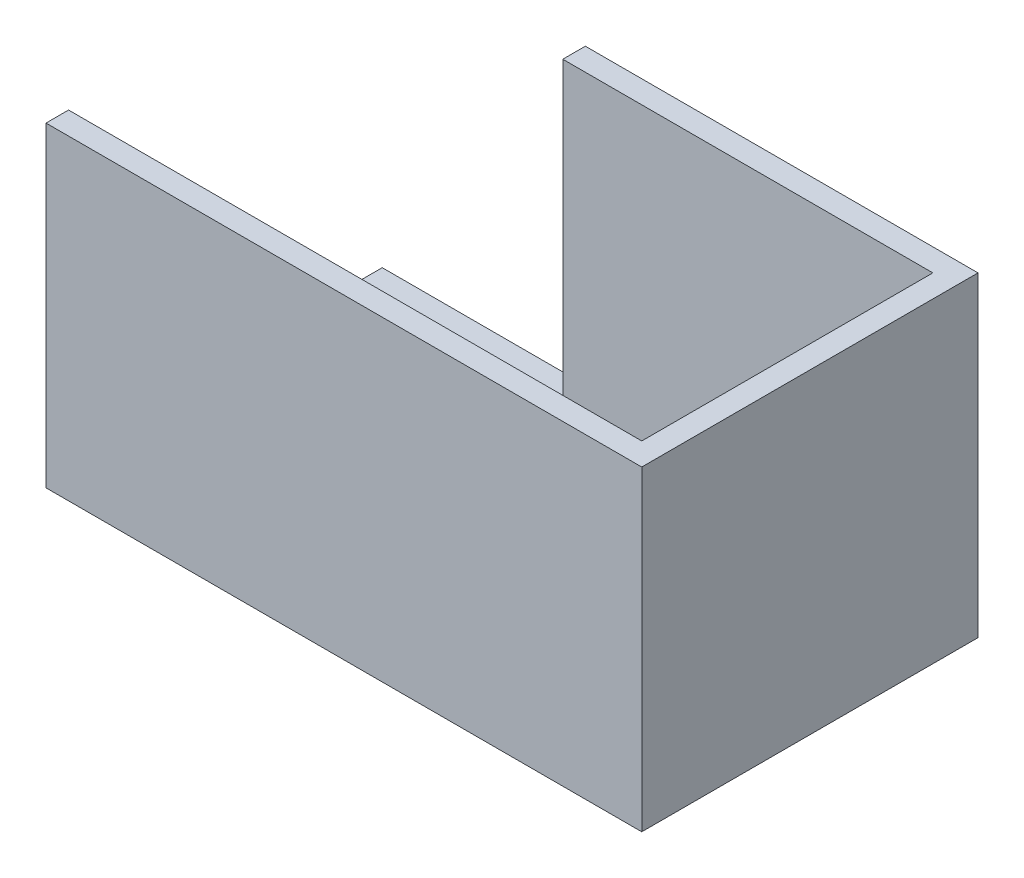
ISO-10303-21;
HEADER;
FILE_DESCRIPTION(('STEP AP214'),'2;1');
FILE_NAME('part.step','',(''),(''),'','','');
FILE_SCHEMA(('AUTOMOTIVE_DESIGN { 1 0 10303 214 1 1 1 1 }'));
ENDSEC;
DATA;
#1=APPLICATION_CONTEXT('core data for automotive mechanical design processes');
#2=APPLICATION_PROTOCOL_DEFINITION('international standard','automotive_design',2000,#1);
#3=PRODUCT_CONTEXT('',#1,'mechanical');
#4=PRODUCT('Part','Part','',(#3));
#5=PRODUCT_RELATED_PRODUCT_CATEGORY('part','',(#4));
#6=PRODUCT_DEFINITION_FORMATION('','',#4);
#7=PRODUCT_DEFINITION_CONTEXT('part definition',#1,'design');
#8=PRODUCT_DEFINITION('design','',#6,#7);
#9=PRODUCT_DEFINITION_SHAPE('','',#8);
#10=(LENGTH_UNIT() NAMED_UNIT(*) SI_UNIT(.MILLI.,.METRE.));
#11=(NAMED_UNIT(*) PLANE_ANGLE_UNIT() SI_UNIT($,.RADIAN.));
#12=(NAMED_UNIT(*) SI_UNIT($,.STERADIAN.) SOLID_ANGLE_UNIT());
#13=UNCERTAINTY_MEASURE_WITH_UNIT(LENGTH_MEASURE(1.E-05),#10,'distance_accuracy_value','');
#14=(GEOMETRIC_REPRESENTATION_CONTEXT(3) GLOBAL_UNCERTAINTY_ASSIGNED_CONTEXT((#13)) GLOBAL_UNIT_ASSIGNED_CONTEXT((#10,
#11,#12)) REPRESENTATION_CONTEXT('',''));
#15=CARTESIAN_POINT('',(0.,0.,0.));
#16=DIRECTION('',(0.,0.,1.));
#17=DIRECTION('',(1.,0.,0.));
#18=AXIS2_PLACEMENT_3D('',#15,#16,#17);
#19=CARTESIAN_POINT('',(0.,2.,0.));
#20=DIRECTION('',(0.,1.,0.));
#21=DIRECTION('',(0.,0.,1.));
#22=AXIS2_PLACEMENT_3D('',#19,#20,#21);
#23=PLANE('',#22);
#24=DIRECTION('',(-1.,0.,0.));
#25=VECTOR('',#24,1.);
#26=CARTESIAN_POINT('',(0.,2.,2.));
#27=LINE('',#26,#25);
#28=CARTESIAN_POINT('',(50.8,2.,2.));
#29=VERTEX_POINT('',#28);
#30=CARTESIAN_POINT('',(18.,2.,2.));
#31=VERTEX_POINT('',#30);
#32=EDGE_CURVE('E304',#29,#31,#27,.T.);
#33=ORIENTED_EDGE('',*,*,#32,.T.);
#34=DIRECTION('',(0.,0.,-1.));
#35=VECTOR('',#34,1.);
#36=CARTESIAN_POINT('',(18.,2.,0.));
#37=LINE('',#36,#35);
#38=CARTESIAN_POINT('',(18.,2.,0.));
#39=VERTEX_POINT('',#38);
#40=EDGE_CURVE('E53',#31,#39,#37,.T.);
#41=ORIENTED_EDGE('',*,*,#40,.T.);
#42=DIRECTION('',(-1.,0.,0.));
#43=VECTOR('',#42,1.);
#44=CARTESIAN_POINT('',(0.,2.,0.));
#45=LINE('',#44,#43);
#46=CARTESIAN_POINT('',(0.,2.,0.));
#47=VERTEX_POINT('',#46);
#48=EDGE_CURVE('E61',#39,#47,#45,.T.);
#49=ORIENTED_EDGE('',*,*,#48,.T.);
#50=DIRECTION('',(0.,0.,1.));
#51=VECTOR('',#50,1.);
#52=CARTESIAN_POINT('',(0.,2.,0.));
#53=LINE('',#52,#51);
#54=CARTESIAN_POINT('',(0.,2.,27.8));
#55=VERTEX_POINT('',#54);
#56=EDGE_CURVE('E107',#47,#55,#53,.T.);
#57=ORIENTED_EDGE('',*,*,#56,.T.);
#58=DIRECTION('',(1.,0.,0.));
#59=VECTOR('',#58,1.);
#60=CARTESIAN_POINT('',(0.,2.,27.8));
#61=LINE('',#60,#59);
#62=CARTESIAN_POINT('',(50.8,2.,27.8));
#63=VERTEX_POINT('',#62);
#64=EDGE_CURVE('E283',#55,#63,#61,.T.);
#65=ORIENTED_EDGE('',*,*,#64,.T.);
#66=DIRECTION('',(0.,0.,-1.));
#67=VECTOR('',#66,1.);
#68=CARTESIAN_POINT('',(50.8,2.,0.));
#69=LINE('',#68,#67);
#70=EDGE_CURVE('E306',#63,#29,#69,.T.);
#71=ORIENTED_EDGE('',*,*,#70,.T.);
#72=EDGE_LOOP('',(#33,#41,#49,#57,#65,#71));
#73=FACE_BOUND('',#72,.T.);
#74=ADVANCED_FACE('F38',(#73),#23,.T.);
#75=CARTESIAN_POINT('',(0.,2.,0.));
#76=DIRECTION('',(1.,0.,0.));
#77=DIRECTION('',(0.,0.,-1.));
#78=AXIS2_PLACEMENT_3D('',#75,#76,#77);
#79=PLANE('',#78);
#80=DIRECTION('',(0.,0.,1.));
#81=VECTOR('',#80,1.);
#82=CARTESIAN_POINT('',(0.,0.,0.));
#83=LINE('',#82,#81);
#84=CARTESIAN_POINT('',(0.,0.,0.));
#85=VERTEX_POINT('',#84);
#86=CARTESIAN_POINT('',(0.,0.,29.8));
#87=VERTEX_POINT('',#86);
#88=EDGE_CURVE('E106',#85,#87,#83,.T.);
#89=ORIENTED_EDGE('',*,*,#88,.T.);
#90=DIRECTION('',(0.,-1.,0.));
#91=VECTOR('',#90,1.);
#92=CARTESIAN_POINT('',(0.,2.,29.8));
#93=LINE('',#92,#91);
#94=CARTESIAN_POINT('',(0.,28.,29.8));
#95=VERTEX_POINT('',#94);
#96=EDGE_CURVE('E11',#95,#87,#93,.T.);
#97=ORIENTED_EDGE('',*,*,#96,.F.);
#98=DIRECTION('',(0.,0.,1.));
#99=VECTOR('',#98,1.);
#100=CARTESIAN_POINT('',(0.,28.,0.));
#101=LINE('',#100,#99);
#102=CARTESIAN_POINT('',(0.,28.,27.8));
#103=VERTEX_POINT('',#102);
#104=EDGE_CURVE('E296',#103,#95,#101,.T.);
#105=ORIENTED_EDGE('',*,*,#104,.F.);
#106=DIRECTION('',(0.,-1.,0.));
#107=VECTOR('',#106,1.);
#108=CARTESIAN_POINT('',(0.,28.,27.8));
#109=LINE('',#108,#107);
#110=EDGE_CURVE('E312',#103,#55,#109,.T.);
#111=ORIENTED_EDGE('',*,*,#110,.T.);
#112=ORIENTED_EDGE('',*,*,#56,.F.);
#113=DIRECTION('',(0.,-1.,0.));
#114=VECTOR('',#113,1.);
#115=CARTESIAN_POINT('',(0.,2.,0.));
#116=LINE('',#115,#114);
#117=EDGE_CURVE('E101',#47,#85,#116,.T.);
#118=ORIENTED_EDGE('',*,*,#117,.T.);
#119=EDGE_LOOP('',(#89,#97,#105,#111,#112,#118));
#120=FACE_BOUND('',#119,.T.);
#121=ADVANCED_FACE('F40',(#120),#79,.F.);
#122=CARTESIAN_POINT('',(0.,2.,29.8));
#123=DIRECTION('',(0.,0.,-1.));
#124=DIRECTION('',(-1.,0.,0.));
#125=AXIS2_PLACEMENT_3D('',#122,#123,#124);
#126=PLANE('',#125);
#127=DIRECTION('',(1.,0.,0.));
#128=VECTOR('',#127,1.);
#129=CARTESIAN_POINT('',(0.,0.,29.8));
#130=LINE('',#129,#128);
#131=CARTESIAN_POINT('',(52.8,0.,29.8));
#132=VERTEX_POINT('',#131);
#133=EDGE_CURVE('E92',#87,#132,#130,.T.);
#134=ORIENTED_EDGE('',*,*,#133,.T.);
#135=DIRECTION('',(0.,-1.,0.));
#136=VECTOR('',#135,1.);
#137=CARTESIAN_POINT('',(52.8,2.,29.8));
#138=LINE('',#137,#136);
#139=CARTESIAN_POINT('',(52.8,28.,29.8));
#140=VERTEX_POINT('',#139);
#141=EDGE_CURVE('E46',#140,#132,#138,.T.);
#142=ORIENTED_EDGE('',*,*,#141,.F.);
#143=DIRECTION('',(1.,0.,0.));
#144=VECTOR('',#143,1.);
#145=CARTESIAN_POINT('',(0.,28.,29.8));
#146=LINE('',#145,#144);
#147=EDGE_CURVE('E125',#95,#140,#146,.T.);
#148=ORIENTED_EDGE('',*,*,#147,.F.);
#149=ORIENTED_EDGE('',*,*,#96,.T.);
#150=EDGE_LOOP('',(#134,#142,#148,#149));
#151=FACE_BOUND('',#150,.T.);
#152=ADVANCED_FACE('F119',(#151),#126,.F.);
#153=CARTESIAN_POINT('',(52.8,2.,0.));
#154=DIRECTION('',(-1.,0.,0.));
#155=DIRECTION('',(0.,0.,1.));
#156=AXIS2_PLACEMENT_3D('',#153,#154,#155);
#157=PLANE('',#156);
#158=DIRECTION('',(0.,0.,-1.));
#159=VECTOR('',#158,1.);
#160=CARTESIAN_POINT('',(52.8,0.,0.));
#161=LINE('',#160,#159);
#162=CARTESIAN_POINT('',(52.8,0.,0.));
#163=VERTEX_POINT('',#162);
#164=EDGE_CURVE('E81',#132,#163,#161,.T.);
#165=ORIENTED_EDGE('',*,*,#164,.T.);
#166=DIRECTION('',(0.,-1.,0.));
#167=VECTOR('',#166,1.);
#168=CARTESIAN_POINT('',(52.8,2.,0.));
#169=LINE('',#168,#167);
#170=CARTESIAN_POINT('',(52.8,28.,0.));
#171=VERTEX_POINT('',#170);
#172=EDGE_CURVE('E86',#171,#163,#169,.T.);
#173=ORIENTED_EDGE('',*,*,#172,.F.);
#174=DIRECTION('',(0.,0.,-1.));
#175=VECTOR('',#174,1.);
#176=CARTESIAN_POINT('',(52.8,28.,0.));
#177=LINE('',#176,#175);
#178=EDGE_CURVE('E299',#140,#171,#177,.T.);
#179=ORIENTED_EDGE('',*,*,#178,.F.);
#180=ORIENTED_EDGE('',*,*,#141,.T.);
#181=EDGE_LOOP('',(#165,#173,#179,#180));
#182=FACE_BOUND('',#181,.T.);
#183=ADVANCED_FACE('F83',(#182),#157,.F.);
#184=CARTESIAN_POINT('',(0.,2.,0.));
#185=DIRECTION('',(0.,0.,1.));
#186=DIRECTION('',(1.,0.,0.));
#187=AXIS2_PLACEMENT_3D('',#184,#185,#186);
#188=PLANE('',#187);
#189=DIRECTION('',(-1.,0.,0.));
#190=VECTOR('',#189,1.);
#191=CARTESIAN_POINT('',(0.,0.,0.));
#192=LINE('',#191,#190);
#193=EDGE_CURVE('E91',#163,#85,#192,.T.);
#194=ORIENTED_EDGE('',*,*,#193,.T.);
#195=ORIENTED_EDGE('',*,*,#117,.F.);
#196=ORIENTED_EDGE('',*,*,#48,.F.);
#197=DIRECTION('',(0.,-1.,0.));
#198=VECTOR('',#197,1.);
#199=CARTESIAN_POINT('',(18.,28.,0.));
#200=LINE('',#199,#198);
#201=CARTESIAN_POINT('',(18.,28.,0.));
#202=VERTEX_POINT('',#201);
#203=EDGE_CURVE('E302',#202,#39,#200,.T.);
#204=ORIENTED_EDGE('',*,*,#203,.F.);
#205=DIRECTION('',(-1.,0.,0.));
#206=VECTOR('',#205,1.);
#207=CARTESIAN_POINT('',(0.,28.,0.));
#208=LINE('',#207,#206);
#209=EDGE_CURVE('E100',#171,#202,#208,.T.);
#210=ORIENTED_EDGE('',*,*,#209,.F.);
#211=ORIENTED_EDGE('',*,*,#172,.T.);
#212=EDGE_LOOP('',(#194,#195,#196,#204,#210,#211));
#213=FACE_BOUND('',#212,.T.);
#214=ADVANCED_FACE('F96',(#213),#188,.F.);
#215=CARTESIAN_POINT('',(0.,0.,0.));
#216=DIRECTION('',(0.,1.,0.));
#217=DIRECTION('',(0.,0.,1.));
#218=AXIS2_PLACEMENT_3D('',#215,#216,#217);
#219=PLANE('',#218);
#220=ORIENTED_EDGE('',*,*,#88,.F.);
#221=ORIENTED_EDGE('',*,*,#193,.F.);
#222=ORIENTED_EDGE('',*,*,#164,.F.);
#223=ORIENTED_EDGE('',*,*,#133,.F.);
#224=EDGE_LOOP('',(#220,#221,#222,#223));
#225=FACE_BOUND('',#224,.T.);
#226=ADVANCED_FACE('F104',(#225),#219,.F.);
#227=CARTESIAN_POINT('',(18.,28.,0.));
#228=DIRECTION('',(-1.,0.,0.));
#229=DIRECTION('',(0.,0.,1.));
#230=AXIS2_PLACEMENT_3D('',#227,#228,#229);
#231=PLANE('',#230);
#232=ORIENTED_EDGE('',*,*,#40,.F.);
#233=DIRECTION('',(0.,-1.,0.));
#234=VECTOR('',#233,1.);
#235=CARTESIAN_POINT('',(18.,28.,2.));
#236=LINE('',#235,#234);
#237=CARTESIAN_POINT('',(18.,28.,2.));
#238=VERTEX_POINT('',#237);
#239=EDGE_CURVE('E117',#238,#31,#236,.T.);
#240=ORIENTED_EDGE('',*,*,#239,.F.);
#241=DIRECTION('',(0.,0.,-1.));
#242=VECTOR('',#241,1.);
#243=CARTESIAN_POINT('',(18.,28.,0.));
#244=LINE('',#243,#242);
#245=EDGE_CURVE('E276',#238,#202,#244,.T.);
#246=ORIENTED_EDGE('',*,*,#245,.T.);
#247=ORIENTED_EDGE('',*,*,#203,.T.);
#248=EDGE_LOOP('',(#232,#240,#246,#247));
#249=FACE_BOUND('',#248,.T.);
#250=ADVANCED_FACE('F139',(#249),#231,.T.);
#251=CARTESIAN_POINT('',(0.,28.,2.));
#252=DIRECTION('',(0.,0.,1.));
#253=DIRECTION('',(1.,0.,0.));
#254=AXIS2_PLACEMENT_3D('',#251,#252,#253);
#255=PLANE('',#254);
#256=ORIENTED_EDGE('',*,*,#32,.F.);
#257=DIRECTION('',(0.,-1.,0.));
#258=VECTOR('',#257,1.);
#259=CARTESIAN_POINT('',(50.8,28.,2.));
#260=LINE('',#259,#258);
#261=CARTESIAN_POINT('',(50.8,28.,2.));
#262=VERTEX_POINT('',#261);
#263=EDGE_CURVE('E288',#262,#29,#260,.T.);
#264=ORIENTED_EDGE('',*,*,#263,.F.);
#265=DIRECTION('',(-1.,0.,0.));
#266=VECTOR('',#265,1.);
#267=CARTESIAN_POINT('',(0.,28.,2.));
#268=LINE('',#267,#266);
#269=EDGE_CURVE('E280',#262,#238,#268,.T.);
#270=ORIENTED_EDGE('',*,*,#269,.T.);
#271=ORIENTED_EDGE('',*,*,#239,.T.);
#272=EDGE_LOOP('',(#256,#264,#270,#271));
#273=FACE_BOUND('',#272,.T.);
#274=ADVANCED_FACE('F164',(#273),#255,.T.);
#275=CARTESIAN_POINT('',(50.8,28.,0.));
#276=DIRECTION('',(-1.,0.,0.));
#277=DIRECTION('',(0.,0.,1.));
#278=AXIS2_PLACEMENT_3D('',#275,#276,#277);
#279=PLANE('',#278);
#280=ORIENTED_EDGE('',*,*,#70,.F.);
#281=DIRECTION('',(0.,-1.,0.));
#282=VECTOR('',#281,1.);
#283=CARTESIAN_POINT('',(50.8,28.,27.8));
#284=LINE('',#283,#282);
#285=CARTESIAN_POINT('',(50.8,28.,27.8));
#286=VERTEX_POINT('',#285);
#287=EDGE_CURVE('E315',#286,#63,#284,.T.);
#288=ORIENTED_EDGE('',*,*,#287,.F.);
#289=DIRECTION('',(0.,0.,-1.));
#290=VECTOR('',#289,1.);
#291=CARTESIAN_POINT('',(50.8,28.,0.));
#292=LINE('',#291,#290);
#293=EDGE_CURVE('E289',#286,#262,#292,.T.);
#294=ORIENTED_EDGE('',*,*,#293,.T.);
#295=ORIENTED_EDGE('',*,*,#263,.T.);
#296=EDGE_LOOP('',(#280,#288,#294,#295));
#297=FACE_BOUND('',#296,.T.);
#298=ADVANCED_FACE('F170',(#297),#279,.T.);
#299=CARTESIAN_POINT('',(0.,28.,27.8));
#300=DIRECTION('',(0.,0.,-1.));
#301=DIRECTION('',(-1.,0.,0.));
#302=AXIS2_PLACEMENT_3D('',#299,#300,#301);
#303=PLANE('',#302);
#304=ORIENTED_EDGE('',*,*,#64,.F.);
#305=ORIENTED_EDGE('',*,*,#110,.F.);
#306=DIRECTION('',(1.,0.,0.));
#307=VECTOR('',#306,1.);
#308=CARTESIAN_POINT('',(0.,28.,27.8));
#309=LINE('',#308,#307);
#310=EDGE_CURVE('E291',#103,#286,#309,.T.);
#311=ORIENTED_EDGE('',*,*,#310,.T.);
#312=ORIENTED_EDGE('',*,*,#287,.T.);
#313=EDGE_LOOP('',(#304,#305,#311,#312));
#314=FACE_BOUND('',#313,.T.);
#315=ADVANCED_FACE('F177',(#314),#303,.T.);
#316=CARTESIAN_POINT('',(0.,28.,0.));
#317=DIRECTION('',(0.,1.,0.));
#318=DIRECTION('',(0.,0.,1.));
#319=AXIS2_PLACEMENT_3D('',#316,#317,#318);
#320=PLANE('',#319);
#321=ORIENTED_EDGE('',*,*,#245,.F.);
#322=ORIENTED_EDGE('',*,*,#269,.F.);
#323=ORIENTED_EDGE('',*,*,#293,.F.);
#324=ORIENTED_EDGE('',*,*,#310,.F.);
#325=ORIENTED_EDGE('',*,*,#104,.T.);
#326=ORIENTED_EDGE('',*,*,#147,.T.);
#327=ORIENTED_EDGE('',*,*,#178,.T.);
#328=ORIENTED_EDGE('',*,*,#209,.T.);
#329=EDGE_LOOP('',(#321,#322,#323,#324,#325,#326,#327,#328));
#330=FACE_BOUND('',#329,.T.);
#331=ADVANCED_FACE('F185',(#330),#320,.T.);
#332=CLOSED_SHELL('',(#74,#121,#152,#183,#214,#226,#250,#274,#298,#315,#331));
#333=MANIFOLD_SOLID_BREP('B2',#332);
#334=ADVANCED_BREP_SHAPE_REPRESENTATION('',(#18,#333),#14);
#335=SHAPE_DEFINITION_REPRESENTATION(#9,#334);
ENDSEC;
END-ISO-10303-21;
